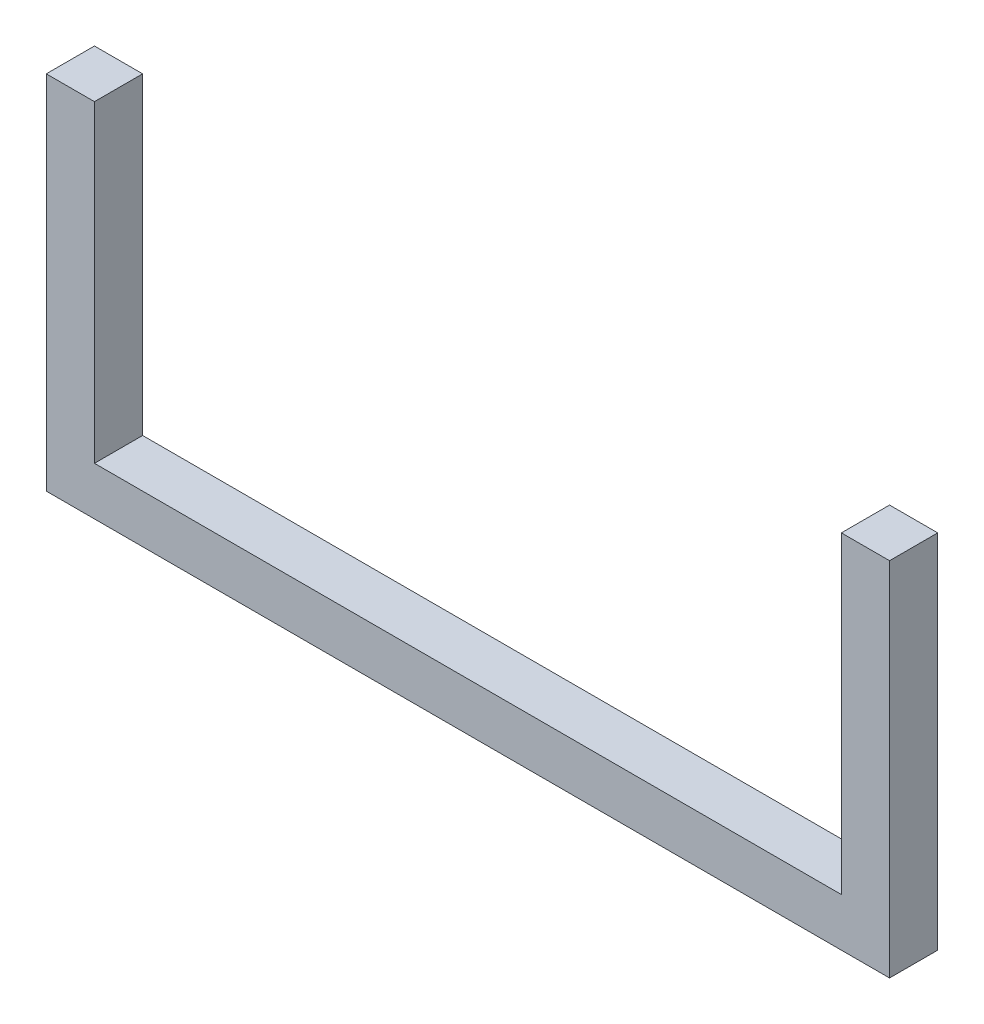
ISO-10303-21;
HEADER;
FILE_DESCRIPTION(('STEP AP214'),'2;1');
FILE_NAME('part.step','',(''),(''),'','','');
FILE_SCHEMA(('AUTOMOTIVE_DESIGN { 1 0 10303 214 1 1 1 1 }'));
ENDSEC;
DATA;
#1=APPLICATION_CONTEXT('core data for automotive mechanical design processes');
#2=APPLICATION_PROTOCOL_DEFINITION('international standard','automotive_design',2000,#1);
#3=PRODUCT_CONTEXT('',#1,'mechanical');
#4=PRODUCT('Part','Part','',(#3));
#5=PRODUCT_RELATED_PRODUCT_CATEGORY('part','',(#4));
#6=PRODUCT_DEFINITION_FORMATION('','',#4);
#7=PRODUCT_DEFINITION_CONTEXT('part definition',#1,'design');
#8=PRODUCT_DEFINITION('design','',#6,#7);
#9=PRODUCT_DEFINITION_SHAPE('','',#8);
#10=(LENGTH_UNIT() NAMED_UNIT(*) SI_UNIT(.MILLI.,.METRE.));
#11=(NAMED_UNIT(*) PLANE_ANGLE_UNIT() SI_UNIT($,.RADIAN.));
#12=(NAMED_UNIT(*) SI_UNIT($,.STERADIAN.) SOLID_ANGLE_UNIT());
#13=UNCERTAINTY_MEASURE_WITH_UNIT(LENGTH_MEASURE(1.E-05),#10,'distance_accuracy_value','');
#14=(GEOMETRIC_REPRESENTATION_CONTEXT(3) GLOBAL_UNCERTAINTY_ASSIGNED_CONTEXT((#13)) GLOBAL_UNIT_ASSIGNED_CONTEXT((#10,
#11,#12)) REPRESENTATION_CONTEXT('',''));
#15=CARTESIAN_POINT('',(0.,0.,0.));
#16=DIRECTION('',(0.,0.,1.));
#17=DIRECTION('',(1.,0.,0.));
#18=AXIS2_PLACEMENT_3D('',#15,#16,#17);
#19=CARTESIAN_POINT('',(0.,150.,20.));
#20=DIRECTION('',(-1.,0.,0.));
#21=DIRECTION('',(0.,-1.,0.));
#22=AXIS2_PLACEMENT_3D('',#19,#20,#21);
#23=PLANE('',#22);
#24=DIRECTION('',(0.,1.,0.));
#25=VECTOR('',#24,1.);
#26=CARTESIAN_POINT('',(0.,150.,0.));
#27=LINE('',#26,#25);
#28=CARTESIAN_POINT('',(0.,0.,0.));
#29=VERTEX_POINT('',#28);
#30=CARTESIAN_POINT('',(0.,150.,0.));
#31=VERTEX_POINT('',#30);
#32=EDGE_CURVE('E128',#29,#31,#27,.T.);
#33=ORIENTED_EDGE('',*,*,#32,.T.);
#34=DIRECTION('',(0.,0.,-1.));
#35=VECTOR('',#34,1.);
#36=CARTESIAN_POINT('',(0.,150.,20.));
#37=LINE('',#36,#35);
#38=CARTESIAN_POINT('',(0.,150.,20.));
#39=VERTEX_POINT('',#38);
#40=EDGE_CURVE('E11',#39,#31,#37,.T.);
#41=ORIENTED_EDGE('',*,*,#40,.F.);
#42=DIRECTION('',(0.,1.,0.));
#43=VECTOR('',#42,1.);
#44=CARTESIAN_POINT('',(0.,150.,20.));
#45=LINE('',#44,#43);
#46=CARTESIAN_POINT('',(0.,0.,20.));
#47=VERTEX_POINT('',#46);
#48=EDGE_CURVE('E142',#47,#39,#45,.T.);
#49=ORIENTED_EDGE('',*,*,#48,.F.);
#50=DIRECTION('',(0.,0.,-1.));
#51=VECTOR('',#50,1.);
#52=CARTESIAN_POINT('',(0.,0.,20.));
#53=LINE('',#52,#51);
#54=EDGE_CURVE('E124',#47,#29,#53,.T.);
#55=ORIENTED_EDGE('',*,*,#54,.T.);
#56=EDGE_LOOP('',(#33,#41,#49,#55));
#57=FACE_BOUND('',#56,.T.);
#58=ADVANCED_FACE('F32',(#57),#23,.F.);
#59=CARTESIAN_POINT('',(-20.,150.,20.));
#60=DIRECTION('',(0.,-1.,0.));
#61=DIRECTION('',(1.,0.,0.));
#62=AXIS2_PLACEMENT_3D('',#59,#60,#61);
#63=PLANE('',#62);
#64=DIRECTION('',(-1.,0.,0.));
#65=VECTOR('',#64,1.);
#66=CARTESIAN_POINT('',(-20.,150.,0.));
#67=LINE('',#66,#65);
#68=CARTESIAN_POINT('',(-20.,150.,0.));
#69=VERTEX_POINT('',#68);
#70=EDGE_CURVE('E131',#31,#69,#67,.T.);
#71=ORIENTED_EDGE('',*,*,#70,.T.);
#72=DIRECTION('',(0.,0.,-1.));
#73=VECTOR('',#72,1.);
#74=CARTESIAN_POINT('',(-20.,150.,20.));
#75=LINE('',#74,#73);
#76=CARTESIAN_POINT('',(-20.,150.,20.));
#77=VERTEX_POINT('',#76);
#78=EDGE_CURVE('E40',#77,#69,#75,.T.);
#79=ORIENTED_EDGE('',*,*,#78,.F.);
#80=DIRECTION('',(-1.,0.,0.));
#81=VECTOR('',#80,1.);
#82=CARTESIAN_POINT('',(-20.,150.,20.));
#83=LINE('',#82,#81);
#84=EDGE_CURVE('E91',#39,#77,#83,.T.);
#85=ORIENTED_EDGE('',*,*,#84,.F.);
#86=ORIENTED_EDGE('',*,*,#40,.T.);
#87=EDGE_LOOP('',(#71,#79,#85,#86));
#88=FACE_BOUND('',#87,.T.);
#89=ADVANCED_FACE('F177',(#88),#63,.F.);
#90=CARTESIAN_POINT('',(-20.,20.,20.));
#91=DIRECTION('',(1.,0.,0.));
#92=DIRECTION('',(0.,1.,0.));
#93=AXIS2_PLACEMENT_3D('',#90,#91,#92);
#94=PLANE('',#93);
#95=DIRECTION('',(0.,-1.,0.));
#96=VECTOR('',#95,1.);
#97=CARTESIAN_POINT('',(-20.,20.,0.));
#98=LINE('',#97,#96);
#99=CARTESIAN_POINT('',(-20.,20.,0.));
#100=VERTEX_POINT('',#99);
#101=EDGE_CURVE('E133',#69,#100,#98,.T.);
#102=ORIENTED_EDGE('',*,*,#101,.T.);
#103=DIRECTION('',(0.,0.,-1.));
#104=VECTOR('',#103,1.);
#105=CARTESIAN_POINT('',(-20.,20.,20.));
#106=LINE('',#105,#104);
#107=CARTESIAN_POINT('',(-20.,20.,20.));
#108=VERTEX_POINT('',#107);
#109=EDGE_CURVE('E149',#108,#100,#106,.T.);
#110=ORIENTED_EDGE('',*,*,#109,.F.);
#111=DIRECTION('',(0.,-1.,0.));
#112=VECTOR('',#111,1.);
#113=CARTESIAN_POINT('',(-20.,20.,20.));
#114=LINE('',#113,#112);
#115=EDGE_CURVE('E157',#77,#108,#114,.T.);
#116=ORIENTED_EDGE('',*,*,#115,.F.);
#117=ORIENTED_EDGE('',*,*,#78,.T.);
#118=EDGE_LOOP('',(#102,#110,#116,#117));
#119=FACE_BOUND('',#118,.T.);
#120=ADVANCED_FACE('F155',(#119),#94,.F.);
#121=CARTESIAN_POINT('',(-330.,20.,20.));
#122=DIRECTION('',(0.,-1.,0.));
#123=DIRECTION('',(1.,0.,0.));
#124=AXIS2_PLACEMENT_3D('',#121,#122,#123);
#125=PLANE('',#124);
#126=DIRECTION('',(-1.,0.,0.));
#127=VECTOR('',#126,1.);
#128=CARTESIAN_POINT('',(-330.,20.,0.));
#129=LINE('',#128,#127);
#130=CARTESIAN_POINT('',(-330.,20.,0.));
#131=VERTEX_POINT('',#130);
#132=EDGE_CURVE('E135',#100,#131,#129,.T.);
#133=ORIENTED_EDGE('',*,*,#132,.T.);
#134=DIRECTION('',(0.,0.,-1.));
#135=VECTOR('',#134,1.);
#136=CARTESIAN_POINT('',(-330.,20.,20.));
#137=LINE('',#136,#135);
#138=CARTESIAN_POINT('',(-330.,20.,20.));
#139=VERTEX_POINT('',#138);
#140=EDGE_CURVE('E146',#139,#131,#137,.T.);
#141=ORIENTED_EDGE('',*,*,#140,.F.);
#142=DIRECTION('',(-1.,0.,0.));
#143=VECTOR('',#142,1.);
#144=CARTESIAN_POINT('',(-330.,20.,20.));
#145=LINE('',#144,#143);
#146=EDGE_CURVE('E169',#108,#139,#145,.T.);
#147=ORIENTED_EDGE('',*,*,#146,.F.);
#148=ORIENTED_EDGE('',*,*,#109,.T.);
#149=EDGE_LOOP('',(#133,#141,#147,#148));
#150=FACE_BOUND('',#149,.T.);
#151=ADVANCED_FACE('F165',(#150),#125,.F.);
#152=CARTESIAN_POINT('',(-330.,150.,20.));
#153=DIRECTION('',(-1.,0.,0.));
#154=DIRECTION('',(0.,0.,1.));
#155=AXIS2_PLACEMENT_3D('',#152,#153,#154);
#156=PLANE('',#155);
#157=DIRECTION('',(0.,1.,0.));
#158=VECTOR('',#157,1.);
#159=CARTESIAN_POINT('',(-330.,150.,0.));
#160=LINE('',#159,#158);
#161=CARTESIAN_POINT('',(-330.,150.,0.));
#162=VERTEX_POINT('',#161);
#163=EDGE_CURVE('E137',#131,#162,#160,.T.);
#164=ORIENTED_EDGE('',*,*,#163,.T.);
#165=DIRECTION('',(0.,0.,-1.));
#166=VECTOR('',#165,1.);
#167=CARTESIAN_POINT('',(-330.,150.,20.));
#168=LINE('',#167,#166);
#169=CARTESIAN_POINT('',(-330.,150.,20.));
#170=VERTEX_POINT('',#169);
#171=EDGE_CURVE('E119',#170,#162,#168,.T.);
#172=ORIENTED_EDGE('',*,*,#171,.F.);
#173=DIRECTION('',(0.,1.,0.));
#174=VECTOR('',#173,1.);
#175=CARTESIAN_POINT('',(-330.,150.,20.));
#176=LINE('',#175,#174);
#177=EDGE_CURVE('E110',#139,#170,#176,.T.);
#178=ORIENTED_EDGE('',*,*,#177,.F.);
#179=ORIENTED_EDGE('',*,*,#140,.T.);
#180=EDGE_LOOP('',(#164,#172,#178,#179));
#181=FACE_BOUND('',#180,.T.);
#182=ADVANCED_FACE('F168',(#181),#156,.F.);
#183=CARTESIAN_POINT('',(-350.,150.,20.));
#184=DIRECTION('',(0.,-1.,0.));
#185=DIRECTION('',(0.,0.,-1.));
#186=AXIS2_PLACEMENT_3D('',#183,#184,#185);
#187=PLANE('',#186);
#188=DIRECTION('',(-1.,0.,0.));
#189=VECTOR('',#188,1.);
#190=CARTESIAN_POINT('',(-350.,150.,0.));
#191=LINE('',#190,#189);
#192=CARTESIAN_POINT('',(-350.,150.,0.));
#193=VERTEX_POINT('',#192);
#194=EDGE_CURVE('E118',#162,#193,#191,.T.);
#195=ORIENTED_EDGE('',*,*,#194,.T.);
#196=DIRECTION('',(0.,0.,-1.));
#197=VECTOR('',#196,1.);
#198=CARTESIAN_POINT('',(-350.,150.,20.));
#199=LINE('',#198,#197);
#200=CARTESIAN_POINT('',(-350.,150.,20.));
#201=VERTEX_POINT('',#200);
#202=EDGE_CURVE('E115',#201,#193,#199,.T.);
#203=ORIENTED_EDGE('',*,*,#202,.F.);
#204=DIRECTION('',(-1.,0.,0.));
#205=VECTOR('',#204,1.);
#206=CARTESIAN_POINT('',(-350.,150.,20.));
#207=LINE('',#206,#205);
#208=EDGE_CURVE('E104',#170,#201,#207,.T.);
#209=ORIENTED_EDGE('',*,*,#208,.F.);
#210=ORIENTED_EDGE('',*,*,#171,.T.);
#211=EDGE_LOOP('',(#195,#203,#209,#210));
#212=FACE_BOUND('',#211,.T.);
#213=ADVANCED_FACE('F116',(#212),#187,.F.);
#214=CARTESIAN_POINT('',(-350.,0.,20.));
#215=DIRECTION('',(1.,0.,0.));
#216=DIRECTION('',(0.,0.,-1.));
#217=AXIS2_PLACEMENT_3D('',#214,#215,#216);
#218=PLANE('',#217);
#219=DIRECTION('',(0.,-1.,0.));
#220=VECTOR('',#219,1.);
#221=CARTESIAN_POINT('',(-350.,0.,0.));
#222=LINE('',#221,#220);
#223=CARTESIAN_POINT('',(-350.,0.,0.));
#224=VERTEX_POINT('',#223);
#225=EDGE_CURVE('E77',#193,#224,#222,.T.);
#226=ORIENTED_EDGE('',*,*,#225,.T.);
#227=DIRECTION('',(0.,0.,-1.));
#228=VECTOR('',#227,1.);
#229=CARTESIAN_POINT('',(-350.,0.,20.));
#230=LINE('',#229,#228);
#231=CARTESIAN_POINT('',(-350.,0.,20.));
#232=VERTEX_POINT('',#231);
#233=EDGE_CURVE('E120',#232,#224,#230,.T.);
#234=ORIENTED_EDGE('',*,*,#233,.F.);
#235=DIRECTION('',(0.,-1.,0.));
#236=VECTOR('',#235,1.);
#237=CARTESIAN_POINT('',(-350.,0.,20.));
#238=LINE('',#237,#236);
#239=EDGE_CURVE('E108',#201,#232,#238,.T.);
#240=ORIENTED_EDGE('',*,*,#239,.F.);
#241=ORIENTED_EDGE('',*,*,#202,.T.);
#242=EDGE_LOOP('',(#226,#234,#240,#241));
#243=FACE_BOUND('',#242,.T.);
#244=ADVANCED_FACE('F122',(#243),#218,.F.);
#245=CARTESIAN_POINT('',(0.,0.,20.));
#246=DIRECTION('',(0.,1.,0.));
#247=DIRECTION('',(0.,0.,1.));
#248=AXIS2_PLACEMENT_3D('',#245,#246,#247);
#249=PLANE('',#248);
#250=DIRECTION('',(1.,0.,0.));
#251=VECTOR('',#250,1.);
#252=CARTESIAN_POINT('',(0.,0.,0.));
#253=LINE('',#252,#251);
#254=EDGE_CURVE('E83',#224,#29,#253,.T.);
#255=ORIENTED_EDGE('',*,*,#254,.T.);
#256=ORIENTED_EDGE('',*,*,#54,.F.);
#257=DIRECTION('',(1.,0.,0.));
#258=VECTOR('',#257,1.);
#259=CARTESIAN_POINT('',(0.,0.,20.));
#260=LINE('',#259,#258);
#261=EDGE_CURVE('E48',#232,#47,#260,.T.);
#262=ORIENTED_EDGE('',*,*,#261,.F.);
#263=ORIENTED_EDGE('',*,*,#233,.T.);
#264=EDGE_LOOP('',(#255,#256,#262,#263));
#265=FACE_BOUND('',#264,.T.);
#266=ADVANCED_FACE('F193',(#265),#249,.F.);
#267=CARTESIAN_POINT('',(0.,0.,20.));
#268=DIRECTION('',(0.,0.,-1.));
#269=DIRECTION('',(-1.,0.,0.));
#270=AXIS2_PLACEMENT_3D('',#267,#268,#269);
#271=PLANE('',#270);
#272=ORIENTED_EDGE('',*,*,#48,.T.);
#273=ORIENTED_EDGE('',*,*,#84,.T.);
#274=ORIENTED_EDGE('',*,*,#115,.T.);
#275=ORIENTED_EDGE('',*,*,#146,.T.);
#276=ORIENTED_EDGE('',*,*,#177,.T.);
#277=ORIENTED_EDGE('',*,*,#208,.T.);
#278=ORIENTED_EDGE('',*,*,#239,.T.);
#279=ORIENTED_EDGE('',*,*,#261,.T.);
#280=EDGE_LOOP('',(#272,#273,#274,#275,#276,#277,#278,#279));
#281=FACE_BOUND('',#280,.T.);
#282=ADVANCED_FACE('F106',(#281),#271,.F.);
#283=CARTESIAN_POINT('',(0.,0.,0.));
#284=DIRECTION('',(0.,0.,-1.));
#285=DIRECTION('',(-1.,0.,0.));
#286=AXIS2_PLACEMENT_3D('',#283,#284,#285);
#287=PLANE('',#286);
#288=ORIENTED_EDGE('',*,*,#32,.F.);
#289=ORIENTED_EDGE('',*,*,#254,.F.);
#290=ORIENTED_EDGE('',*,*,#225,.F.);
#291=ORIENTED_EDGE('',*,*,#194,.F.);
#292=ORIENTED_EDGE('',*,*,#163,.F.);
#293=ORIENTED_EDGE('',*,*,#132,.F.);
#294=ORIENTED_EDGE('',*,*,#101,.F.);
#295=ORIENTED_EDGE('',*,*,#70,.F.);
#296=EDGE_LOOP('',(#288,#289,#290,#291,#292,#293,#294,#295));
#297=FACE_BOUND('',#296,.T.);
#298=ADVANCED_FACE('F161',(#297),#287,.T.);
#299=CLOSED_SHELL('',(#58,#89,#120,#151,#182,#213,#244,#266,#282,#298));
#300=MANIFOLD_SOLID_BREP('B2',#299);
#301=ADVANCED_BREP_SHAPE_REPRESENTATION('',(#18,#300),#14);
#302=SHAPE_DEFINITION_REPRESENTATION(#9,#301);
ENDSEC;
END-ISO-10303-21;
